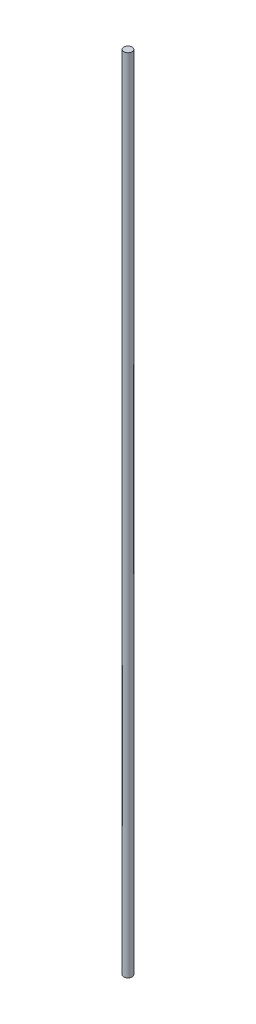
ISO-10303-21;
HEADER;
FILE_DESCRIPTION(('STEP AP214'),'2;1');
FILE_NAME('part.step','',(''),(''),'','','');
FILE_SCHEMA(('AUTOMOTIVE_DESIGN { 1 0 10303 214 1 1 1 1 }'));
ENDSEC;
DATA;
#1=APPLICATION_CONTEXT('core data for automotive mechanical design processes');
#2=APPLICATION_PROTOCOL_DEFINITION('international standard','automotive_design',2000,#1);
#3=PRODUCT_CONTEXT('',#1,'mechanical');
#4=PRODUCT('Part','Part','',(#3));
#5=PRODUCT_RELATED_PRODUCT_CATEGORY('part','',(#4));
#6=PRODUCT_DEFINITION_FORMATION('','',#4);
#7=PRODUCT_DEFINITION_CONTEXT('part definition',#1,'design');
#8=PRODUCT_DEFINITION('design','',#6,#7);
#9=PRODUCT_DEFINITION_SHAPE('','',#8);
#10=(LENGTH_UNIT() NAMED_UNIT(*) SI_UNIT(.MILLI.,.METRE.));
#11=(NAMED_UNIT(*) PLANE_ANGLE_UNIT() SI_UNIT($,.RADIAN.));
#12=(NAMED_UNIT(*) SI_UNIT($,.STERADIAN.) SOLID_ANGLE_UNIT());
#13=UNCERTAINTY_MEASURE_WITH_UNIT(LENGTH_MEASURE(1.E-05),#10,'distance_accuracy_value','');
#14=(GEOMETRIC_REPRESENTATION_CONTEXT(3) GLOBAL_UNCERTAINTY_ASSIGNED_CONTEXT((#13)) GLOBAL_UNIT_ASSIGNED_CONTEXT((#10,
#11,#12)) REPRESENTATION_CONTEXT('',''));
#15=CARTESIAN_POINT('',(0.,0.,0.));
#16=DIRECTION('',(0.,0.,1.));
#17=DIRECTION('',(1.,0.,0.));
#18=AXIS2_PLACEMENT_3D('',#15,#16,#17);
#19=CARTESIAN_POINT('',(0.,384.,0.));
#20=DIRECTION('',(0.,-1.,0.));
#21=DIRECTION('',(0.,0.,-1.));
#22=AXIS2_PLACEMENT_3D('',#19,#20,#21);
#23=CYLINDRICAL_SURFACE('',#22,3.97);
#24=CARTESIAN_POINT('',(0.,384.,0.));
#25=DIRECTION('',(0.,1.,0.));
#26=DIRECTION('',(0.,0.,1.));
#27=AXIS2_PLACEMENT_3D('',#24,#25,#26);
#28=CIRCLE('',#27,3.97);
#29=CARTESIAN_POINT('',(0.,384.,3.97));
#30=VERTEX_POINT('',#29);
#31=EDGE_CURVE('E10',#30,#30,#28,.T.);
#32=ORIENTED_EDGE('',*,*,#31,.F.);
#33=EDGE_LOOP('',(#32));
#34=FACE_BOUND('',#33,.T.);
#35=CARTESIAN_POINT('',(0.,-384.,0.));
#36=DIRECTION('',(0.,1.,0.));
#37=DIRECTION('',(0.,0.,1.));
#38=AXIS2_PLACEMENT_3D('',#35,#36,#37);
#39=CIRCLE('',#38,3.97);
#40=CARTESIAN_POINT('',(0.,-384.,3.97));
#41=VERTEX_POINT('',#40);
#42=EDGE_CURVE('E39',#41,#41,#39,.T.);
#43=ORIENTED_EDGE('',*,*,#42,.T.);
#44=EDGE_LOOP('',(#43));
#45=FACE_BOUND('',#44,.T.);
#46=ADVANCED_FACE('F36',(#34,#45),#23,.T.);
#47=CARTESIAN_POINT('',(0.,384.,0.));
#48=DIRECTION('',(0.,1.,0.));
#49=DIRECTION('',(0.,0.,1.));
#50=AXIS2_PLACEMENT_3D('',#47,#48,#49);
#51=PLANE('',#50);
#52=ORIENTED_EDGE('',*,*,#31,.T.);
#53=EDGE_LOOP('',(#52));
#54=FACE_BOUND('',#53,.T.);
#55=ADVANCED_FACE('F51',(#54),#51,.T.);
#56=CARTESIAN_POINT('',(0.,-384.,0.));
#57=DIRECTION('',(0.,1.,0.));
#58=DIRECTION('',(0.,0.,1.));
#59=AXIS2_PLACEMENT_3D('',#56,#57,#58);
#60=PLANE('',#59);
#61=ORIENTED_EDGE('',*,*,#42,.F.);
#62=EDGE_LOOP('',(#61));
#63=FACE_BOUND('',#62,.T.);
#64=ADVANCED_FACE('F49',(#63),#60,.F.);
#65=CLOSED_SHELL('',(#46,#55,#64));
#66=MANIFOLD_SOLID_BREP('B2',#65);
#67=ADVANCED_BREP_SHAPE_REPRESENTATION('',(#18,#66),#14);
#68=SHAPE_DEFINITION_REPRESENTATION(#9,#67);
ENDSEC;
END-ISO-10303-21;
